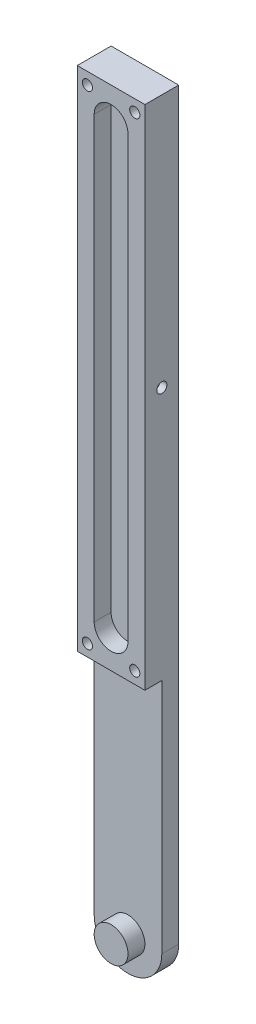
ISO-10303-21;
HEADER;
FILE_DESCRIPTION(('STEP AP214'),'2;1');
FILE_NAME('part.step','',(''),(''),'','','');
FILE_SCHEMA(('AUTOMOTIVE_DESIGN { 1 0 10303 214 1 1 1 1 }'));
ENDSEC;
DATA;
#1=APPLICATION_CONTEXT('core data for automotive mechanical design processes');
#2=APPLICATION_PROTOCOL_DEFINITION('international standard','automotive_design',2000,#1);
#3=PRODUCT_CONTEXT('',#1,'mechanical');
#4=PRODUCT('Part','Part','',(#3));
#5=PRODUCT_RELATED_PRODUCT_CATEGORY('part','',(#4));
#6=PRODUCT_DEFINITION_FORMATION('','',#4);
#7=PRODUCT_DEFINITION_CONTEXT('part definition',#1,'design');
#8=PRODUCT_DEFINITION('design','',#6,#7);
#9=PRODUCT_DEFINITION_SHAPE('','',#8);
#10=(LENGTH_UNIT() NAMED_UNIT(*) SI_UNIT(.MILLI.,.METRE.));
#11=(NAMED_UNIT(*) PLANE_ANGLE_UNIT() SI_UNIT($,.RADIAN.));
#12=(NAMED_UNIT(*) SI_UNIT($,.STERADIAN.) SOLID_ANGLE_UNIT());
#13=UNCERTAINTY_MEASURE_WITH_UNIT(LENGTH_MEASURE(1.E-05),#10,'distance_accuracy_value','');
#14=(GEOMETRIC_REPRESENTATION_CONTEXT(3) GLOBAL_UNCERTAINTY_ASSIGNED_CONTEXT((#13)) GLOBAL_UNIT_ASSIGNED_CONTEXT((#10,
#11,#12)) REPRESENTATION_CONTEXT('',''));
#15=CARTESIAN_POINT('',(0.,0.,0.));
#16=DIRECTION('',(0.,0.,1.));
#17=DIRECTION('',(1.,0.,0.));
#18=AXIS2_PLACEMENT_3D('',#15,#16,#17);
#19=CARTESIAN_POINT('',(10.,-150.,5.));
#20=DIRECTION('',(-1.,0.,0.));
#21=DIRECTION('',(0.,-1.,0.));
#22=AXIS2_PLACEMENT_3D('',#19,#20,#21);
#23=PLANE('',#22);
#24=DIRECTION('',(0.,1.,0.));
#25=VECTOR('',#24,1.);
#26=CARTESIAN_POINT('',(10.,-150.,-5.));
#27=LINE('',#26,#25);
#28=CARTESIAN_POINT('',(10.,-220.,-5.));
#29=VERTEX_POINT('',#28);
#30=CARTESIAN_POINT('',(10.,0.,-5.));
#31=VERTEX_POINT('',#30);
#32=EDGE_CURVE('E96',#29,#31,#27,.T.);
#33=ORIENTED_EDGE('',*,*,#32,.T.);
#34=DIRECTION('',(0.,0.,-1.));
#35=VECTOR('',#34,1.);
#36=CARTESIAN_POINT('',(10.,0.,5.));
#37=LINE('',#36,#35);
#38=CARTESIAN_POINT('',(10.,0.,5.));
#39=VERTEX_POINT('',#38);
#40=EDGE_CURVE('E10',#39,#31,#37,.T.);
#41=ORIENTED_EDGE('',*,*,#40,.F.);
#42=DIRECTION('',(0.,1.,0.));
#43=VECTOR('',#42,1.);
#44=CARTESIAN_POINT('',(10.,-150.,5.));
#45=LINE('',#44,#43);
#46=CARTESIAN_POINT('',(10.,-150.,5.));
#47=VERTEX_POINT('',#46);
#48=EDGE_CURVE('E205',#47,#39,#45,.T.);
#49=ORIENTED_EDGE('',*,*,#48,.F.);
#50=DIRECTION('',(0.,0.,-1.));
#51=VECTOR('',#50,1.);
#52=CARTESIAN_POINT('',(10.,-150.,5.));
#53=LINE('',#52,#51);
#54=CARTESIAN_POINT('',(10.,-150.,0.));
#55=VERTEX_POINT('',#54);
#56=EDGE_CURVE('E218',#47,#55,#53,.T.);
#57=ORIENTED_EDGE('',*,*,#56,.T.);
#58=DIRECTION('',(0.,1.,0.));
#59=VECTOR('',#58,1.);
#60=CARTESIAN_POINT('',(10.,-150.,0.));
#61=LINE('',#60,#59);
#62=CARTESIAN_POINT('',(10.,-220.,0.));
#63=VERTEX_POINT('',#62);
#64=EDGE_CURVE('E113',#63,#55,#61,.T.);
#65=ORIENTED_EDGE('',*,*,#64,.F.);
#66=DIRECTION('',(0.,0.,1.));
#67=VECTOR('',#66,1.);
#68=CARTESIAN_POINT('',(10.,-220.,-87.4621125123532));
#69=LINE('',#68,#67);
#70=EDGE_CURVE('E110',#29,#63,#69,.T.);
#71=ORIENTED_EDGE('',*,*,#70,.F.);
#72=EDGE_LOOP('',(#33,#41,#49,#57,#65,#71));
#73=FACE_BOUND('',#72,.T.);
#74=CARTESIAN_POINT('',(10.,-75.,0.));
#75=DIRECTION('',(-1.,0.,0.));
#76=DIRECTION('',(0.,-1.,0.));
#77=AXIS2_PLACEMENT_3D('',#74,#75,#76);
#78=CIRCLE('',#77,1.5);
#79=CARTESIAN_POINT('',(10.,-76.5,0.));
#80=VERTEX_POINT('',#79);
#81=EDGE_CURVE('E250',#80,#80,#78,.T.);
#82=ORIENTED_EDGE('',*,*,#81,.T.);
#83=EDGE_LOOP('',(#82));
#84=FACE_BOUND('',#83,.T.);
#85=ADVANCED_FACE('F16',(#73,#84),#23,.F.);
#86=CARTESIAN_POINT('',(0.,-220.,0.));
#87=DIRECTION('',(0.,0.,1.));
#88=DIRECTION('',(0.,-1.,0.));
#89=AXIS2_PLACEMENT_3D('',#86,#87,#88);
#90=PLANE('',#89);
#91=DIRECTION('',(0.,-1.,0.));
#92=VECTOR('',#91,1.);
#93=CARTESIAN_POINT('',(-10.,-150.,0.));
#94=LINE('',#93,#92);
#95=CARTESIAN_POINT('',(-10.,-150.,0.));
#96=VERTEX_POINT('',#95);
#97=CARTESIAN_POINT('',(-10.,-220.,0.));
#98=VERTEX_POINT('',#97);
#99=EDGE_CURVE('E234',#96,#98,#94,.T.);
#100=ORIENTED_EDGE('',*,*,#99,.T.);
#101=CARTESIAN_POINT('',(0.,-220.,0.));
#102=DIRECTION('',(0.,0.,1.));
#103=DIRECTION('',(0.,-1.,0.));
#104=AXIS2_PLACEMENT_3D('',#101,#102,#103);
#105=CIRCLE('',#104,10.);
#106=EDGE_CURVE('E127',#98,#63,#105,.T.);
#107=ORIENTED_EDGE('',*,*,#106,.T.);
#108=ORIENTED_EDGE('',*,*,#64,.T.);
#109=DIRECTION('',(-1.,0.,0.));
#110=VECTOR('',#109,1.);
#111=CARTESIAN_POINT('',(-10.,-150.,0.));
#112=LINE('',#111,#110);
#113=EDGE_CURVE('E33',#55,#96,#112,.T.);
#114=ORIENTED_EDGE('',*,*,#113,.T.);
#115=EDGE_LOOP('',(#100,#107,#108,#114));
#116=FACE_BOUND('',#115,.T.);
#117=CARTESIAN_POINT('',(0.,-220.,0.));
#118=DIRECTION('',(0.,0.,1.));
#119=DIRECTION('',(0.,-1.,0.));
#120=AXIS2_PLACEMENT_3D('',#117,#118,#119);
#121=CIRCLE('',#120,5.);
#122=CARTESIAN_POINT('',(0.,-225.,0.));
#123=VERTEX_POINT('',#122);
#124=EDGE_CURVE('E242',#123,#123,#121,.T.);
#125=ORIENTED_EDGE('',*,*,#124,.F.);
#126=EDGE_LOOP('',(#125));
#127=FACE_BOUND('',#126,.T.);
#128=ADVANCED_FACE('F271',(#116,#127),#90,.T.);
#129=CARTESIAN_POINT('',(-10.,-150.,5.));
#130=DIRECTION('',(0.,1.,0.));
#131=DIRECTION('',(-1.,0.,0.));
#132=AXIS2_PLACEMENT_3D('',#129,#130,#131);
#133=PLANE('',#132);
#134=ORIENTED_EDGE('',*,*,#113,.F.);
#135=ORIENTED_EDGE('',*,*,#56,.F.);
#136=DIRECTION('',(1.,0.,0.));
#137=VECTOR('',#136,1.);
#138=CARTESIAN_POINT('',(-10.,-150.,5.));
#139=LINE('',#138,#137);
#140=CARTESIAN_POINT('',(-10.,-150.,5.));
#141=VERTEX_POINT('',#140);
#142=EDGE_CURVE('E216',#141,#47,#139,.T.);
#143=ORIENTED_EDGE('',*,*,#142,.F.);
#144=DIRECTION('',(0.,0.,-1.));
#145=VECTOR('',#144,1.);
#146=CARTESIAN_POINT('',(-10.,-150.,5.));
#147=LINE('',#146,#145);
#148=EDGE_CURVE('E231',#141,#96,#147,.T.);
#149=ORIENTED_EDGE('',*,*,#148,.T.);
#150=EDGE_LOOP('',(#134,#135,#143,#149));
#151=FACE_BOUND('',#150,.T.);
#152=ADVANCED_FACE('F275',(#151),#133,.F.);
#153=CARTESIAN_POINT('',(-10.,0.,5.));
#154=DIRECTION('',(0.,-1.,0.));
#155=DIRECTION('',(1.,0.,0.));
#156=AXIS2_PLACEMENT_3D('',#153,#154,#155);
#157=PLANE('',#156);
#158=DIRECTION('',(-1.,0.,0.));
#159=VECTOR('',#158,1.);
#160=CARTESIAN_POINT('',(-10.,0.,-5.));
#161=LINE('',#160,#159);
#162=CARTESIAN_POINT('',(-10.,0.,-5.));
#163=VERTEX_POINT('',#162);
#164=EDGE_CURVE('E103',#31,#163,#161,.T.);
#165=ORIENTED_EDGE('',*,*,#164,.T.);
#166=DIRECTION('',(0.,0.,-1.));
#167=VECTOR('',#166,1.);
#168=CARTESIAN_POINT('',(-10.,0.,5.));
#169=LINE('',#168,#167);
#170=CARTESIAN_POINT('',(-10.,0.,5.));
#171=VERTEX_POINT('',#170);
#172=EDGE_CURVE('E25',#171,#163,#169,.T.);
#173=ORIENTED_EDGE('',*,*,#172,.F.);
#174=DIRECTION('',(-1.,0.,0.));
#175=VECTOR('',#174,1.);
#176=CARTESIAN_POINT('',(-10.,0.,5.));
#177=LINE('',#176,#175);
#178=EDGE_CURVE('E209',#39,#171,#177,.T.);
#179=ORIENTED_EDGE('',*,*,#178,.F.);
#180=ORIENTED_EDGE('',*,*,#40,.T.);
#181=EDGE_LOOP('',(#165,#173,#179,#180));
#182=FACE_BOUND('',#181,.T.);
#183=ADVANCED_FACE('F281',(#182),#157,.F.);
#184=CARTESIAN_POINT('',(-10.,-150.,5.));
#185=DIRECTION('',(1.,0.,0.));
#186=DIRECTION('',(0.,1.,0.));
#187=AXIS2_PLACEMENT_3D('',#184,#185,#186);
#188=PLANE('',#187);
#189=DIRECTION('',(0.,-1.,0.));
#190=VECTOR('',#189,1.);
#191=CARTESIAN_POINT('',(-10.,-150.,-5.));
#192=LINE('',#191,#190);
#193=CARTESIAN_POINT('',(-10.,-220.,-5.));
#194=VERTEX_POINT('',#193);
#195=EDGE_CURVE('E210',#163,#194,#192,.T.);
#196=ORIENTED_EDGE('',*,*,#195,.T.);
#197=DIRECTION('',(0.,0.,1.));
#198=VECTOR('',#197,1.);
#199=CARTESIAN_POINT('',(-10.,-220.,-87.4621125123532));
#200=LINE('',#199,#198);
#201=EDGE_CURVE('E118',#194,#98,#200,.T.);
#202=ORIENTED_EDGE('',*,*,#201,.T.);
#203=ORIENTED_EDGE('',*,*,#99,.F.);
#204=ORIENTED_EDGE('',*,*,#148,.F.);
#205=DIRECTION('',(0.,-1.,0.));
#206=VECTOR('',#205,1.);
#207=CARTESIAN_POINT('',(-10.,-150.,5.));
#208=LINE('',#207,#206);
#209=EDGE_CURVE('E213',#171,#141,#208,.T.);
#210=ORIENTED_EDGE('',*,*,#209,.F.);
#211=ORIENTED_EDGE('',*,*,#172,.T.);
#212=EDGE_LOOP('',(#196,#202,#203,#204,#210,#211));
#213=FACE_BOUND('',#212,.T.);
#214=ADVANCED_FACE('F344',(#213),#188,.F.);
#215=CARTESIAN_POINT('',(0.,-75.,5.));
#216=DIRECTION('',(0.,0.,-1.));
#217=DIRECTION('',(0.,1.,0.));
#218=AXIS2_PLACEMENT_3D('',#215,#216,#217);
#219=PLANE('',#218);
#220=CARTESIAN_POINT('',(7.,-146.5,5.));
#221=DIRECTION('',(0.,0.,1.));
#222=DIRECTION('',(0.,-1.,0.));
#223=AXIS2_PLACEMENT_3D('',#220,#221,#222);
#224=CIRCLE('',#223,1.5);
#225=CARTESIAN_POINT('',(7.,-148.,5.));
#226=VERTEX_POINT('',#225);
#227=EDGE_CURVE('E132',#226,#226,#224,.T.);
#228=ORIENTED_EDGE('',*,*,#227,.F.);
#229=EDGE_LOOP('',(#228));
#230=FACE_BOUND('',#229,.T.);
#231=CARTESIAN_POINT('',(-7.,-146.5,5.));
#232=DIRECTION('',(0.,0.,1.));
#233=DIRECTION('',(0.,-1.,0.));
#234=AXIS2_PLACEMENT_3D('',#231,#232,#233);
#235=CIRCLE('',#234,1.5);
#236=CARTESIAN_POINT('',(-7.,-148.,5.));
#237=VERTEX_POINT('',#236);
#238=EDGE_CURVE('E137',#237,#237,#235,.T.);
#239=ORIENTED_EDGE('',*,*,#238,.F.);
#240=EDGE_LOOP('',(#239));
#241=FACE_BOUND('',#240,.T.);
#242=CARTESIAN_POINT('',(-7.,-3.5,5.));
#243=DIRECTION('',(0.,0.,1.));
#244=DIRECTION('',(0.,-1.,0.));
#245=AXIS2_PLACEMENT_3D('',#242,#243,#244);
#246=CIRCLE('',#245,1.5);
#247=CARTESIAN_POINT('',(-7.,-5.,5.));
#248=VERTEX_POINT('',#247);
#249=EDGE_CURVE('E145',#248,#248,#246,.T.);
#250=ORIENTED_EDGE('',*,*,#249,.F.);
#251=EDGE_LOOP('',(#250));
#252=FACE_BOUND('',#251,.T.);
#253=CARTESIAN_POINT('',(7.,-3.5,5.));
#254=DIRECTION('',(0.,0.,1.));
#255=DIRECTION('',(0.,-1.,0.));
#256=AXIS2_PLACEMENT_3D('',#253,#254,#255);
#257=CIRCLE('',#256,1.5);
#258=CARTESIAN_POINT('',(7.,-5.,5.));
#259=VERTEX_POINT('',#258);
#260=EDGE_CURVE('E153',#259,#259,#257,.T.);
#261=ORIENTED_EDGE('',*,*,#260,.F.);
#262=EDGE_LOOP('',(#261));
#263=FACE_BOUND('',#262,.T.);
#264=DIRECTION('',(0.,1.,0.));
#265=VECTOR('',#264,1.);
#266=CARTESIAN_POINT('',(5.,-140.,5.));
#267=LINE('',#266,#265);
#268=CARTESIAN_POINT('',(5.,-140.,5.));
#269=VERTEX_POINT('',#268);
#270=CARTESIAN_POINT('',(5.,-10.,5.));
#271=VERTEX_POINT('',#270);
#272=EDGE_CURVE('E184',#269,#271,#267,.T.);
#273=ORIENTED_EDGE('',*,*,#272,.F.);
#274=CARTESIAN_POINT('',(0.,-140.,5.));
#275=DIRECTION('',(0.,0.,1.));
#276=DIRECTION('',(0.,-1.,0.));
#277=AXIS2_PLACEMENT_3D('',#274,#275,#276);
#278=CIRCLE('',#277,5.);
#279=CARTESIAN_POINT('',(-5.,-140.,5.));
#280=VERTEX_POINT('',#279);
#281=EDGE_CURVE('E41',#280,#269,#278,.T.);
#282=ORIENTED_EDGE('',*,*,#281,.F.);
#283=DIRECTION('',(0.,-1.,0.));
#284=VECTOR('',#283,1.);
#285=CARTESIAN_POINT('',(-5.,-140.,5.));
#286=LINE('',#285,#284);
#287=CARTESIAN_POINT('',(-5.,-10.,5.));
#288=VERTEX_POINT('',#287);
#289=EDGE_CURVE('E169',#288,#280,#286,.T.);
#290=ORIENTED_EDGE('',*,*,#289,.F.);
#291=CARTESIAN_POINT('',(0.,-10.,5.));
#292=DIRECTION('',(0.,0.,1.));
#293=DIRECTION('',(0.,-1.,0.));
#294=AXIS2_PLACEMENT_3D('',#291,#292,#293);
#295=CIRCLE('',#294,5.);
#296=EDGE_CURVE('E188',#271,#288,#295,.T.);
#297=ORIENTED_EDGE('',*,*,#296,.F.);
#298=EDGE_LOOP('',(#273,#282,#290,#297));
#299=FACE_BOUND('',#298,.T.);
#300=ORIENTED_EDGE('',*,*,#48,.T.);
#301=ORIENTED_EDGE('',*,*,#178,.T.);
#302=ORIENTED_EDGE('',*,*,#209,.T.);
#303=ORIENTED_EDGE('',*,*,#142,.T.);
#304=EDGE_LOOP('',(#300,#301,#302,#303));
#305=FACE_BOUND('',#304,.T.);
#306=ADVANCED_FACE('F341',(#230,#241,#252,#263,#299,#305),#219,.F.);
#307=CARTESIAN_POINT('',(0.,-75.,-5.));
#308=DIRECTION('',(0.,0.,-1.));
#309=DIRECTION('',(0.,1.,0.));
#310=AXIS2_PLACEMENT_3D('',#307,#308,#309);
#311=PLANE('',#310);
#312=ORIENTED_EDGE('',*,*,#32,.F.);
#313=CARTESIAN_POINT('',(0.,-220.,-5.));
#314=DIRECTION('',(0.,0.,-1.));
#315=DIRECTION('',(0.,1.,0.));
#316=AXIS2_PLACEMENT_3D('',#313,#314,#315);
#317=CIRCLE('',#316,10.);
#318=EDGE_CURVE('E101',#194,#29,#317,.F.);
#319=ORIENTED_EDGE('',*,*,#318,.F.);
#320=ORIENTED_EDGE('',*,*,#195,.F.);
#321=ORIENTED_EDGE('',*,*,#164,.F.);
#322=EDGE_LOOP('',(#312,#319,#320,#321));
#323=FACE_BOUND('',#322,.T.);
#324=ADVANCED_FACE('F98',(#323),#311,.T.);
#325=CARTESIAN_POINT('',(0.,-140.,0.));
#326=DIRECTION('',(0.,0.,1.));
#327=DIRECTION('',(0.,-1.,0.));
#328=AXIS2_PLACEMENT_3D('',#325,#326,#327);
#329=CYLINDRICAL_SURFACE('',#328,5.);
#330=ORIENTED_EDGE('',*,*,#281,.T.);
#331=DIRECTION('',(0.,0.,1.));
#332=VECTOR('',#331,1.);
#333=CARTESIAN_POINT('',(5.,-140.,0.));
#334=LINE('',#333,#332);
#335=CARTESIAN_POINT('',(5.,-140.,0.));
#336=VERTEX_POINT('',#335);
#337=EDGE_CURVE('E181',#336,#269,#334,.T.);
#338=ORIENTED_EDGE('',*,*,#337,.F.);
#339=CARTESIAN_POINT('',(0.,-140.,0.));
#340=DIRECTION('',(0.,0.,1.));
#341=DIRECTION('',(0.,-1.,0.));
#342=AXIS2_PLACEMENT_3D('',#339,#340,#341);
#343=CIRCLE('',#342,5.);
#344=CARTESIAN_POINT('',(-5.,-140.,0.));
#345=VERTEX_POINT('',#344);
#346=EDGE_CURVE('E164',#345,#336,#343,.T.);
#347=ORIENTED_EDGE('',*,*,#346,.F.);
#348=DIRECTION('',(0.,0.,1.));
#349=VECTOR('',#348,1.);
#350=CARTESIAN_POINT('',(-5.,-140.,0.));
#351=LINE('',#350,#349);
#352=EDGE_CURVE('E107',#345,#280,#351,.T.);
#353=ORIENTED_EDGE('',*,*,#352,.T.);
#354=EDGE_LOOP('',(#330,#338,#347,#353));
#355=FACE_BOUND('',#354,.T.);
#356=ADVANCED_FACE('F331',(#355),#329,.F.);
#357=CARTESIAN_POINT('',(-5.,-140.,0.));
#358=DIRECTION('',(-1.,0.,0.));
#359=DIRECTION('',(0.,-1.,0.));
#360=AXIS2_PLACEMENT_3D('',#357,#358,#359);
#361=PLANE('',#360);
#362=ORIENTED_EDGE('',*,*,#289,.T.);
#363=ORIENTED_EDGE('',*,*,#352,.F.);
#364=DIRECTION('',(0.,-1.,0.));
#365=VECTOR('',#364,1.);
#366=CARTESIAN_POINT('',(-5.,-140.,0.));
#367=LINE('',#366,#365);
#368=CARTESIAN_POINT('',(-5.,-10.,0.));
#369=VERTEX_POINT('',#368);
#370=EDGE_CURVE('E177',#369,#345,#367,.T.);
#371=ORIENTED_EDGE('',*,*,#370,.F.);
#372=DIRECTION('',(0.,0.,1.));
#373=VECTOR('',#372,1.);
#374=CARTESIAN_POINT('',(-5.,-10.,0.));
#375=LINE('',#374,#373);
#376=EDGE_CURVE('E197',#369,#288,#375,.T.);
#377=ORIENTED_EDGE('',*,*,#376,.T.);
#378=EDGE_LOOP('',(#362,#363,#371,#377));
#379=FACE_BOUND('',#378,.T.);
#380=ADVANCED_FACE('F327',(#379),#361,.F.);
#381=CARTESIAN_POINT('',(0.,-10.,0.));
#382=DIRECTION('',(0.,0.,1.));
#383=DIRECTION('',(0.,-1.,0.));
#384=AXIS2_PLACEMENT_3D('',#381,#382,#383);
#385=CYLINDRICAL_SURFACE('',#384,5.);
#386=ORIENTED_EDGE('',*,*,#296,.T.);
#387=ORIENTED_EDGE('',*,*,#376,.F.);
#388=CARTESIAN_POINT('',(0.,-10.,0.));
#389=DIRECTION('',(0.,0.,1.));
#390=DIRECTION('',(0.,-1.,0.));
#391=AXIS2_PLACEMENT_3D('',#388,#389,#390);
#392=CIRCLE('',#391,5.);
#393=CARTESIAN_POINT('',(5.,-10.,0.));
#394=VERTEX_POINT('',#393);
#395=EDGE_CURVE('E173',#394,#369,#392,.T.);
#396=ORIENTED_EDGE('',*,*,#395,.F.);
#397=DIRECTION('',(0.,0.,1.));
#398=VECTOR('',#397,1.);
#399=CARTESIAN_POINT('',(5.,-10.,0.));
#400=LINE('',#399,#398);
#401=EDGE_CURVE('E200',#394,#271,#400,.T.);
#402=ORIENTED_EDGE('',*,*,#401,.T.);
#403=EDGE_LOOP('',(#386,#387,#396,#402));
#404=FACE_BOUND('',#403,.T.);
#405=ADVANCED_FACE('F330',(#404),#385,.F.);
#406=CARTESIAN_POINT('',(5.,-140.,0.));
#407=DIRECTION('',(1.,0.,0.));
#408=DIRECTION('',(0.,1.,0.));
#409=AXIS2_PLACEMENT_3D('',#406,#407,#408);
#410=PLANE('',#409);
#411=ORIENTED_EDGE('',*,*,#272,.T.);
#412=ORIENTED_EDGE('',*,*,#401,.F.);
#413=DIRECTION('',(0.,1.,0.));
#414=VECTOR('',#413,1.);
#415=CARTESIAN_POINT('',(5.,-140.,0.));
#416=LINE('',#415,#414);
#417=EDGE_CURVE('E168',#336,#394,#416,.T.);
#418=ORIENTED_EDGE('',*,*,#417,.F.);
#419=ORIENTED_EDGE('',*,*,#337,.T.);
#420=EDGE_LOOP('',(#411,#412,#418,#419));
#421=FACE_BOUND('',#420,.T.);
#422=ADVANCED_FACE('F325',(#421),#410,.F.);
#423=CARTESIAN_POINT('',(0.,-140.,0.));
#424=DIRECTION('',(0.,0.,1.));
#425=DIRECTION('',(0.,-1.,0.));
#426=AXIS2_PLACEMENT_3D('',#423,#424,#425);
#427=PLANE('',#426);
#428=ORIENTED_EDGE('',*,*,#346,.T.);
#429=ORIENTED_EDGE('',*,*,#417,.T.);
#430=ORIENTED_EDGE('',*,*,#395,.T.);
#431=ORIENTED_EDGE('',*,*,#370,.T.);
#432=EDGE_LOOP('',(#428,#429,#430,#431));
#433=FACE_BOUND('',#432,.T.);
#434=ADVANCED_FACE('F321',(#433),#427,.T.);
#435=CARTESIAN_POINT('',(7.,-3.5,0.));
#436=DIRECTION('',(0.,0.,1.));
#437=DIRECTION('',(0.,-1.,0.));
#438=AXIS2_PLACEMENT_3D('',#435,#436,#437);
#439=CYLINDRICAL_SURFACE('',#438,1.5);
#440=CARTESIAN_POINT('',(7.,-3.5,0.));
#441=DIRECTION('',(0.,0.,1.));
#442=DIRECTION('',(0.,-1.,0.));
#443=AXIS2_PLACEMENT_3D('',#440,#441,#442);
#444=CIRCLE('',#443,1.5);
#445=CARTESIAN_POINT('',(7.,-5.,0.));
#446=VERTEX_POINT('',#445);
#447=EDGE_CURVE('E157',#446,#446,#444,.T.);
#448=ORIENTED_EDGE('',*,*,#447,.F.);
#449=EDGE_LOOP('',(#448));
#450=FACE_BOUND('',#449,.T.);
#451=ORIENTED_EDGE('',*,*,#260,.T.);
#452=EDGE_LOOP('',(#451));
#453=FACE_BOUND('',#452,.T.);
#454=ADVANCED_FACE('F317',(#450,#453),#439,.F.);
#455=CARTESIAN_POINT('',(7.,-3.5,0.));
#456=DIRECTION('',(0.,0.,1.));
#457=DIRECTION('',(0.,-1.,0.));
#458=AXIS2_PLACEMENT_3D('',#455,#456,#457);
#459=PLANE('',#458);
#460=ORIENTED_EDGE('',*,*,#447,.T.);
#461=EDGE_LOOP('',(#460));
#462=FACE_BOUND('',#461,.T.);
#463=ADVANCED_FACE('F313',(#462),#459,.T.);
#464=CARTESIAN_POINT('',(-7.,-3.5,0.));
#465=DIRECTION('',(0.,0.,1.));
#466=DIRECTION('',(0.,-1.,0.));
#467=AXIS2_PLACEMENT_3D('',#464,#465,#466);
#468=CYLINDRICAL_SURFACE('',#467,1.5);
#469=CARTESIAN_POINT('',(-7.,-3.5,0.));
#470=DIRECTION('',(0.,0.,1.));
#471=DIRECTION('',(0.,-1.,0.));
#472=AXIS2_PLACEMENT_3D('',#469,#470,#471);
#473=CIRCLE('',#472,1.5);
#474=CARTESIAN_POINT('',(-7.,-5.,0.));
#475=VERTEX_POINT('',#474);
#476=EDGE_CURVE('E149',#475,#475,#473,.T.);
#477=ORIENTED_EDGE('',*,*,#476,.F.);
#478=EDGE_LOOP('',(#477));
#479=FACE_BOUND('',#478,.T.);
#480=ORIENTED_EDGE('',*,*,#249,.T.);
#481=EDGE_LOOP('',(#480));
#482=FACE_BOUND('',#481,.T.);
#483=ADVANCED_FACE('F309',(#479,#482),#468,.F.);
#484=CARTESIAN_POINT('',(-7.,-3.5,0.));
#485=DIRECTION('',(0.,0.,1.));
#486=DIRECTION('',(0.,-1.,0.));
#487=AXIS2_PLACEMENT_3D('',#484,#485,#486);
#488=PLANE('',#487);
#489=ORIENTED_EDGE('',*,*,#476,.T.);
#490=EDGE_LOOP('',(#489));
#491=FACE_BOUND('',#490,.T.);
#492=ADVANCED_FACE('F305',(#491),#488,.T.);
#493=CARTESIAN_POINT('',(-7.,-146.5,0.));
#494=DIRECTION('',(0.,0.,1.));
#495=DIRECTION('',(0.,-1.,0.));
#496=AXIS2_PLACEMENT_3D('',#493,#494,#495);
#497=CYLINDRICAL_SURFACE('',#496,1.5);
#498=CARTESIAN_POINT('',(-7.,-146.5,0.));
#499=DIRECTION('',(0.,0.,1.));
#500=DIRECTION('',(0.,-1.,0.));
#501=AXIS2_PLACEMENT_3D('',#498,#499,#500);
#502=CIRCLE('',#501,1.5);
#503=CARTESIAN_POINT('',(-7.,-148.,0.));
#504=VERTEX_POINT('',#503);
#505=EDGE_CURVE('E141',#504,#504,#502,.T.);
#506=ORIENTED_EDGE('',*,*,#505,.F.);
#507=EDGE_LOOP('',(#506));
#508=FACE_BOUND('',#507,.T.);
#509=ORIENTED_EDGE('',*,*,#238,.T.);
#510=EDGE_LOOP('',(#509));
#511=FACE_BOUND('',#510,.T.);
#512=ADVANCED_FACE('F301',(#508,#511),#497,.F.);
#513=CARTESIAN_POINT('',(-7.,-146.5,0.));
#514=DIRECTION('',(0.,0.,1.));
#515=DIRECTION('',(0.,-1.,0.));
#516=AXIS2_PLACEMENT_3D('',#513,#514,#515);
#517=PLANE('',#516);
#518=ORIENTED_EDGE('',*,*,#505,.T.);
#519=EDGE_LOOP('',(#518));
#520=FACE_BOUND('',#519,.T.);
#521=ADVANCED_FACE('F297',(#520),#517,.T.);
#522=CARTESIAN_POINT('',(7.,-146.5,0.));
#523=DIRECTION('',(0.,0.,1.));
#524=DIRECTION('',(0.,-1.,0.));
#525=AXIS2_PLACEMENT_3D('',#522,#523,#524);
#526=CYLINDRICAL_SURFACE('',#525,1.5);
#527=CARTESIAN_POINT('',(7.,-146.5,0.));
#528=DIRECTION('',(0.,0.,1.));
#529=DIRECTION('',(0.,-1.,0.));
#530=AXIS2_PLACEMENT_3D('',#527,#528,#529);
#531=CIRCLE('',#530,1.5);
#532=CARTESIAN_POINT('',(7.,-148.,0.));
#533=VERTEX_POINT('',#532);
#534=EDGE_CURVE('E133',#533,#533,#531,.T.);
#535=ORIENTED_EDGE('',*,*,#534,.F.);
#536=EDGE_LOOP('',(#535));
#537=FACE_BOUND('',#536,.T.);
#538=ORIENTED_EDGE('',*,*,#227,.T.);
#539=EDGE_LOOP('',(#538));
#540=FACE_BOUND('',#539,.T.);
#541=ADVANCED_FACE('F293',(#537,#540),#526,.F.);
#542=CARTESIAN_POINT('',(7.,-146.5,0.));
#543=DIRECTION('',(0.,0.,1.));
#544=DIRECTION('',(0.,-1.,0.));
#545=AXIS2_PLACEMENT_3D('',#542,#543,#544);
#546=PLANE('',#545);
#547=ORIENTED_EDGE('',*,*,#534,.T.);
#548=EDGE_LOOP('',(#547));
#549=FACE_BOUND('',#548,.T.);
#550=ADVANCED_FACE('F290',(#549),#546,.T.);
#551=CARTESIAN_POINT('',(0.,-220.,-87.4621125123532));
#552=DIRECTION('',(0.,0.,1.));
#553=DIRECTION('',(0.,-1.,0.));
#554=AXIS2_PLACEMENT_3D('',#551,#552,#553);
#555=CYLINDRICAL_SURFACE('',#554,10.);
#556=ORIENTED_EDGE('',*,*,#201,.F.);
#557=ORIENTED_EDGE('',*,*,#318,.T.);
#558=ORIENTED_EDGE('',*,*,#70,.T.);
#559=ORIENTED_EDGE('',*,*,#106,.F.);
#560=EDGE_LOOP('',(#556,#557,#558,#559));
#561=FACE_BOUND('',#560,.T.);
#562=ADVANCED_FACE('F120',(#561),#555,.T.);
#563=CARTESIAN_POINT('',(0.,-220.,5.));
#564=DIRECTION('',(0.,0.,-1.));
#565=DIRECTION('',(0.,1.,0.));
#566=AXIS2_PLACEMENT_3D('',#563,#564,#565);
#567=CYLINDRICAL_SURFACE('',#566,5.);
#568=CARTESIAN_POINT('',(0.,-220.,5.));
#569=DIRECTION('',(0.,0.,1.));
#570=DIRECTION('',(0.,-1.,0.));
#571=AXIS2_PLACEMENT_3D('',#568,#569,#570);
#572=CIRCLE('',#571,5.);
#573=CARTESIAN_POINT('',(0.,-225.,5.));
#574=VERTEX_POINT('',#573);
#575=EDGE_CURVE('E238',#574,#574,#572,.T.);
#576=ORIENTED_EDGE('',*,*,#575,.F.);
#577=EDGE_LOOP('',(#576));
#578=FACE_BOUND('',#577,.T.);
#579=ORIENTED_EDGE('',*,*,#124,.T.);
#580=EDGE_LOOP('',(#579));
#581=FACE_BOUND('',#580,.T.);
#582=ADVANCED_FACE('F286',(#578,#581),#567,.T.);
#583=CARTESIAN_POINT('',(0.,-220.,5.));
#584=DIRECTION('',(0.,0.,1.));
#585=DIRECTION('',(0.,-1.,0.));
#586=AXIS2_PLACEMENT_3D('',#583,#584,#585);
#587=PLANE('',#586);
#588=ORIENTED_EDGE('',*,*,#575,.T.);
#589=EDGE_LOOP('',(#588));
#590=FACE_BOUND('',#589,.T.);
#591=ADVANCED_FACE('F268',(#590),#587,.T.);
#592=CARTESIAN_POINT('',(8.,-75.,0.));
#593=DIRECTION('',(1.,0.,0.));
#594=DIRECTION('',(0.,1.,0.));
#595=AXIS2_PLACEMENT_3D('',#592,#593,#594);
#596=CYLINDRICAL_SURFACE('',#595,1.5);
#597=CARTESIAN_POINT('',(8.,-75.,0.));
#598=DIRECTION('',(-1.,0.,0.));
#599=DIRECTION('',(0.,-1.,0.));
#600=AXIS2_PLACEMENT_3D('',#597,#598,#599);
#601=CIRCLE('',#600,1.5);
#602=CARTESIAN_POINT('',(8.,-76.5,0.));
#603=VERTEX_POINT('',#602);
#604=EDGE_CURVE('E246',#603,#603,#601,.T.);
#605=ORIENTED_EDGE('',*,*,#604,.T.);
#606=EDGE_LOOP('',(#605));
#607=FACE_BOUND('',#606,.T.);
#608=ORIENTED_EDGE('',*,*,#81,.F.);
#609=EDGE_LOOP('',(#608));
#610=FACE_BOUND('',#609,.T.);
#611=ADVANCED_FACE('F258',(#607,#610),#596,.F.);
#612=CARTESIAN_POINT('',(8.,-75.,0.));
#613=DIRECTION('',(-1.,0.,0.));
#614=DIRECTION('',(0.,-1.,0.));
#615=AXIS2_PLACEMENT_3D('',#612,#613,#614);
#616=PLANE('',#615);
#617=ORIENTED_EDGE('',*,*,#604,.F.);
#618=EDGE_LOOP('',(#617));
#619=FACE_BOUND('',#618,.T.);
#620=ADVANCED_FACE('F261',(#619),#616,.F.);
#621=CLOSED_SHELL('',(#85,#128,#152,#183,#214,#306,#324,#356,#380,#405,#422,#434,#454,#463,#483,
#492,#512,#521,#541,#550,#562,#582,#591,#611,#620));
#622=MANIFOLD_SOLID_BREP('B1',#621);
#623=ADVANCED_BREP_SHAPE_REPRESENTATION('',(#18,#622),#14);
#624=SHAPE_DEFINITION_REPRESENTATION(#9,#623);
ENDSEC;
END-ISO-10303-21;
